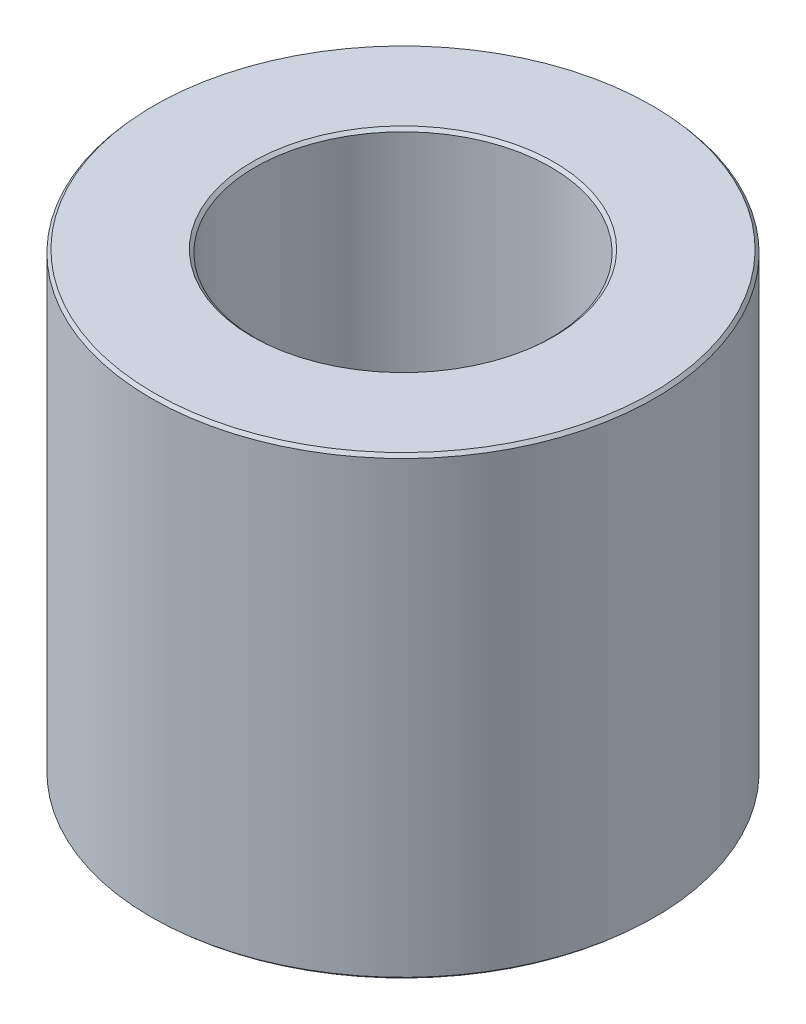
ISO-10303-21;
HEADER;
FILE_DESCRIPTION(('STEP AP214'),'2;1');
FILE_NAME('part.step','',(''),(''),'','','');
FILE_SCHEMA(('AUTOMOTIVE_DESIGN { 1 0 10303 214 1 1 1 1 }'));
ENDSEC;
DATA;
#1=APPLICATION_CONTEXT('core data for automotive mechanical design processes');
#2=APPLICATION_PROTOCOL_DEFINITION('international standard','automotive_design',2000,#1);
#3=PRODUCT_CONTEXT('',#1,'mechanical');
#4=PRODUCT('Part','Part','',(#3));
#5=PRODUCT_RELATED_PRODUCT_CATEGORY('part','',(#4));
#6=PRODUCT_DEFINITION_FORMATION('','',#4);
#7=PRODUCT_DEFINITION_CONTEXT('part definition',#1,'design');
#8=PRODUCT_DEFINITION('design','',#6,#7);
#9=PRODUCT_DEFINITION_SHAPE('','',#8);
#10=(LENGTH_UNIT() NAMED_UNIT(*) SI_UNIT(.MILLI.,.METRE.));
#11=(NAMED_UNIT(*) PLANE_ANGLE_UNIT() SI_UNIT($,.RADIAN.));
#12=(NAMED_UNIT(*) SI_UNIT($,.STERADIAN.) SOLID_ANGLE_UNIT());
#13=UNCERTAINTY_MEASURE_WITH_UNIT(LENGTH_MEASURE(1.E-05),#10,'distance_accuracy_value','');
#14=(GEOMETRIC_REPRESENTATION_CONTEXT(3) GLOBAL_UNCERTAINTY_ASSIGNED_CONTEXT((#13)) GLOBAL_UNIT_ASSIGNED_CONTEXT((#10,
#11,#12)) REPRESENTATION_CONTEXT('',''));
#15=CARTESIAN_POINT('',(0.,0.,0.));
#16=DIRECTION('',(0.,0.,1.));
#17=DIRECTION('',(1.,0.,0.));
#18=AXIS2_PLACEMENT_3D('',#15,#16,#17);
#19=CARTESIAN_POINT('',(0.,31.6429276659521,0.));
#20=DIRECTION('',(0.,-1.,0.));
#21=DIRECTION('',(0.,0.,-1.));
#22=AXIS2_PLACEMENT_3D('',#19,#20,#21);
#23=CYLINDRICAL_SURFACE('',#22,17.5);
#24=CARTESIAN_POINT('',(0.,0.197430008424614,0.));
#25=DIRECTION('',(0.,1.,0.));
#26=DIRECTION('',(0.,0.,1.));
#27=AXIS2_PLACEMENT_3D('',#24,#25,#26);
#28=CIRCLE('',#27,17.5);
#29=CARTESIAN_POINT('',(0.,0.197430008424614,17.5));
#30=VERTEX_POINT('',#29);
#31=EDGE_CURVE('E10',#30,#30,#28,.T.);
#32=ORIENTED_EDGE('',*,*,#31,.T.);
#33=EDGE_LOOP('',(#32));
#34=FACE_BOUND('',#33,.T.);
#35=CARTESIAN_POINT('',(0.,31.4214336692465,0.));
#36=DIRECTION('',(0.,1.,0.));
#37=DIRECTION('',(0.,0.,1.));
#38=AXIS2_PLACEMENT_3D('',#35,#36,#37);
#39=CIRCLE('',#38,17.5);
#40=CARTESIAN_POINT('',(0.,31.4214336692465,17.5));
#41=VERTEX_POINT('',#40);
#42=EDGE_CURVE('E50',#41,#41,#39,.F.);
#43=ORIENTED_EDGE('',*,*,#42,.T.);
#44=EDGE_LOOP('',(#43));
#45=FACE_BOUND('',#44,.T.);
#46=ADVANCED_FACE('F39',(#34,#45),#23,.T.);
#47=CARTESIAN_POINT('',(0.,31.6429276659521,0.));
#48=DIRECTION('',(0.,1.,0.));
#49=DIRECTION('',(0.,0.,1.));
#50=AXIS2_PLACEMENT_3D('',#47,#48,#49);
#51=PLANE('',#50);
#52=CARTESIAN_POINT('',(0.,31.6429276659521,0.));
#53=DIRECTION('',(0.,1.,0.));
#54=DIRECTION('',(0.,0.,1.));
#55=AXIS2_PLACEMENT_3D('',#52,#53,#54);
#56=CIRCLE('',#55,10.5000017148785);
#57=CARTESIAN_POINT('',(0.,31.6429276659521,10.5000017148785));
#58=VERTEX_POINT('',#57);
#59=EDGE_CURVE('E58',#58,#58,#56,.F.);
#60=ORIENTED_EDGE('',*,*,#59,.T.);
#61=EDGE_LOOP('',(#60));
#62=FACE_BOUND('',#61,.T.);
#63=CARTESIAN_POINT('',(0.,31.6429276659521,0.));
#64=DIRECTION('',(0.,1.,0.));
#65=DIRECTION('',(0.,0.,1.));
#66=AXIS2_PLACEMENT_3D('',#63,#64,#65);
#67=CIRCLE('',#66,17.3025699915754);
#68=CARTESIAN_POINT('',(0.,31.6429276659521,17.3025699915754));
#69=VERTEX_POINT('',#68);
#70=EDGE_CURVE('E61',#69,#69,#67,.T.);
#71=ORIENTED_EDGE('',*,*,#70,.T.);
#72=EDGE_LOOP('',(#71));
#73=FACE_BOUND('',#72,.T.);
#74=ADVANCED_FACE('F88',(#62,#73),#51,.T.);
#75=CARTESIAN_POINT('',(0.,0.,0.));
#76=DIRECTION('',(0.,1.,0.));
#77=DIRECTION('',(0.,0.,1.));
#78=AXIS2_PLACEMENT_3D('',#75,#76,#77);
#79=PLANE('',#78);
#80=CARTESIAN_POINT('',(0.,0.,0.));
#81=DIRECTION('',(0.,1.,0.));
#82=DIRECTION('',(0.,0.,1.));
#83=AXIS2_PLACEMENT_3D('',#80,#81,#82);
#84=CIRCLE('',#83,10.4759377265976);
#85=CARTESIAN_POINT('',(0.,0.,10.4759377265976));
#86=VERTEX_POINT('',#85);
#87=EDGE_CURVE('E51',#86,#86,#84,.T.);
#88=ORIENTED_EDGE('',*,*,#87,.T.);
#89=EDGE_LOOP('',(#88));
#90=FACE_BOUND('',#89,.T.);
#91=CARTESIAN_POINT('',(0.,0.,0.));
#92=DIRECTION('',(0.,1.,0.));
#93=DIRECTION('',(0.,0.,1.));
#94=AXIS2_PLACEMENT_3D('',#91,#92,#93);
#95=CIRCLE('',#94,17.2785060032944);
#96=CARTESIAN_POINT('',(0.,0.,17.2785060032944));
#97=VERTEX_POINT('',#96);
#98=EDGE_CURVE('E54',#97,#97,#95,.F.);
#99=ORIENTED_EDGE('',*,*,#98,.T.);
#100=EDGE_LOOP('',(#99));
#101=FACE_BOUND('',#100,.T.);
#102=ADVANCED_FACE('F83',(#90,#101),#79,.F.);
#103=CARTESIAN_POINT('',(0.,31.6429276659521,0.));
#104=DIRECTION('',(0.,-1.,0.));
#105=DIRECTION('',(0.,0.,-1.));
#106=AXIS2_PLACEMENT_3D('',#103,#104,#105);
#107=CYLINDRICAL_SURFACE('',#106,10.2785077181729);
#108=CARTESIAN_POINT('',(0.,31.4454976575275,0.));
#109=DIRECTION('',(0.,1.,0.));
#110=DIRECTION('',(0.,0.,1.));
#111=AXIS2_PLACEMENT_3D('',#108,#109,#110);
#112=CIRCLE('',#111,10.2785077181729);
#113=CARTESIAN_POINT('',(0.,31.4454976575275,10.2785077181729));
#114=VERTEX_POINT('',#113);
#115=EDGE_CURVE('E67',#114,#114,#112,.T.);
#116=ORIENTED_EDGE('',*,*,#115,.T.);
#117=EDGE_LOOP('',(#116));
#118=FACE_BOUND('',#117,.T.);
#119=CARTESIAN_POINT('',(0.,0.221493996705589,0.));
#120=DIRECTION('',(0.,1.,0.));
#121=DIRECTION('',(0.,0.,1.));
#122=AXIS2_PLACEMENT_3D('',#119,#120,#121);
#123=CIRCLE('',#122,10.2785077181729);
#124=CARTESIAN_POINT('',(0.,0.221493996705589,10.2785077181729));
#125=VERTEX_POINT('',#124);
#126=EDGE_CURVE('E69',#125,#125,#123,.F.);
#127=ORIENTED_EDGE('',*,*,#126,.T.);
#128=EDGE_LOOP('',(#127));
#129=FACE_BOUND('',#128,.T.);
#130=ADVANCED_FACE('F71',(#118,#129),#107,.F.);
#131=CARTESIAN_POINT('',(0.,31.4454976575275,0.));
#132=DIRECTION('',(0.,1.,0.));
#133=DIRECTION('',(0.,0.,1.));
#134=AXIS2_PLACEMENT_3D('',#131,#132,#133);
#135=CONICAL_SURFACE('',#134,10.2785077181729,0.842777480112497);
#136=CARTESIAN_POINT('',(0.,31.6429276659521,10.5000017148785));
#137=CARTESIAN_POINT('',(0.,31.6408711033644,10.4976944857462));
#138=CARTESIAN_POINT('',(0.,31.6388145407766,10.4953872566138));
#139=CARTESIAN_POINT('',(0.,31.6347014156011,10.4907727983491));
#140=CARTESIAN_POINT('',(0.,31.6326448530133,10.4884655692168));
#141=CARTESIAN_POINT('',(0.,31.6285317278378,10.4838511109521));
#142=CARTESIAN_POINT('',(0.,31.6264751652501,10.4815438818197));
#143=CARTESIAN_POINT('',(0.,31.6223620400746,10.476929423555));
#144=CARTESIAN_POINT('',(0.,31.6203054774868,10.4746221944227));
#145=CARTESIAN_POINT('',(0.,31.6161923523113,10.470007736158));
#146=CARTESIAN_POINT('',(0.,31.6141357897235,10.4677005070256));
#147=CARTESIAN_POINT('',(0.,31.610022664548,10.4630860487609));
#148=CARTESIAN_POINT('',(0.,31.6079661019603,10.4607788196286));
#149=CARTESIAN_POINT('',(0.,31.6038529767848,10.4561643613639));
#150=CARTESIAN_POINT('',(0.,31.601796414197,10.4538571322315));
#151=CARTESIAN_POINT('',(0.,31.5976832890215,10.4492426739668));
#152=CARTESIAN_POINT('',(0.,31.5956267264337,10.4469354448345));
#153=CARTESIAN_POINT('',(0.,31.5915136012582,10.4423209865698));
#154=CARTESIAN_POINT('',(0.,31.5894570386705,10.4400137574374));
#155=CARTESIAN_POINT('',(0.,31.5853439134949,10.4353992991727));
#156=CARTESIAN_POINT('',(0.,31.5832873509072,10.4330920700404));
#157=CARTESIAN_POINT('',(0.,31.5791742257317,10.4284776117757));
#158=CARTESIAN_POINT('',(0.,31.5771176631439,10.4261703826433));
#159=CARTESIAN_POINT('',(0.,31.5730045379684,10.4215559243786));
#160=CARTESIAN_POINT('',(0.,31.5709479753806,10.4192486952463));
#161=CARTESIAN_POINT('',(0.,31.5668348502051,10.4146342369816));
#162=CARTESIAN_POINT('',(0.,31.5647782876174,10.4123270078492));
#163=CARTESIAN_POINT('',(0.,31.5606651624419,10.4077125495845));
#164=CARTESIAN_POINT('',(0.,31.5586085998541,10.4054053204522));
#165=CARTESIAN_POINT('',(0.,31.5544954746786,10.4007908621875));
#166=CARTESIAN_POINT('',(0.,31.5524389120908,10.3984836330551));
#167=CARTESIAN_POINT('',(0.,31.5483257869153,10.3938691747904));
#168=CARTESIAN_POINT('',(0.,31.5462692243276,10.3915619456581));
#169=CARTESIAN_POINT('',(0.,31.5421560991521,10.3869474873934));
#170=CARTESIAN_POINT('',(0.,31.5400995365643,10.384640258261));
#171=CARTESIAN_POINT('',(0.,31.5359864113888,10.3800257999963));
#172=CARTESIAN_POINT('',(0.,31.533929848801,10.377718570864));
#173=CARTESIAN_POINT('',(0.,31.5298167236255,10.3731041125993));
#174=CARTESIAN_POINT('',(0.,31.5277601610378,10.3707968834669));
#175=CARTESIAN_POINT('',(0.,31.5236470358623,10.3661824252022));
#176=CARTESIAN_POINT('',(0.,31.5215904732745,10.3638751960699));
#177=CARTESIAN_POINT('',(0.,31.517477348099,10.3592607378052));
#178=CARTESIAN_POINT('',(0.,31.5154207855112,10.3569535086728));
#179=CARTESIAN_POINT('',(0.,31.5113076603357,10.3523390504081));
#180=CARTESIAN_POINT('',(0.,31.509251097748,10.3500318212758));
#181=CARTESIAN_POINT('',(0.,31.5051379725724,10.3454173630111));
#182=CARTESIAN_POINT('',(0.,31.5030814099847,10.3431101338787));
#183=CARTESIAN_POINT('',(0.,31.4989682848092,10.338495675614));
#184=CARTESIAN_POINT('',(0.,31.4969117222214,10.3361884464817));
#185=CARTESIAN_POINT('',(0.,31.4927985970459,10.331573988217));
#186=CARTESIAN_POINT('',(0.,31.4907420344581,10.3292667590846));
#187=CARTESIAN_POINT('',(0.,31.4866289092826,10.3246523008199));
#188=CARTESIAN_POINT('',(0.,31.4845723466949,10.3223450716876));
#189=CARTESIAN_POINT('',(0.,31.4804592215194,10.3177306134229));
#190=CARTESIAN_POINT('',(0.,31.4784026589316,10.3154233842905));
#191=CARTESIAN_POINT('',(0.,31.4742895337561,10.3108089260258));
#192=CARTESIAN_POINT('',(0.,31.4722329711683,10.3085016968935));
#193=CARTESIAN_POINT('',(0.,31.4681198459928,10.3038872386288));
#194=CARTESIAN_POINT('',(0.,31.4660632834051,10.3015800094964));
#195=CARTESIAN_POINT('',(0.,31.4619501582296,10.2969655512317));
#196=CARTESIAN_POINT('',(0.,31.4598935956418,10.2946583220994));
#197=CARTESIAN_POINT('',(0.,31.4557804704663,10.2900438638347));
#198=CARTESIAN_POINT('',(0.,31.4537239078785,10.2877366347023));
#199=CARTESIAN_POINT('',(0.,31.449610782703,10.2831221764376));
#200=CARTESIAN_POINT('',(0.,31.4475542201153,10.2808149473053));
#201=CARTESIAN_POINT('',(0.,31.4454976575275,10.2785077181729));
#202=B_SPLINE_CURVE_WITH_KNOTS('',3,(#136,#137,#138,#139,#140,#141,#142,#143,#144,#145,#146,
#147,#148,#149,#150,#151,#152,#153,#154,#155,#156,#157,#158,#159,#160,#161,#162,#163,#164,#165,
#166,#167,#168,#169,#170,#171,#172,#173,#174,#175,#176,#177,#178,#179,#180,#181,#182,#183,#184,
#185,#186,#187,#188,#189,#190,#191,#192,#193,#194,#195,#196,#197,#198,#199,#200,#201),
.UNSPECIFIED.,.F.,.F.,(4,2,2,2,2,2,2,2,2,2,2,2,2,2,2,2,2,2,2,2,2,2,2,2,2,2,2,2,2,2,2,2,4),(0.,
0.00927225989274612,0.0185445197854982,0.0278167796782489,0.0370890395709996,0.0463612994637504,
0.0556335593565011,0.0649058192492472,0.0741780791419993,0.08345033903475,0.0927225989275007,
0.101994858820251,0.111267118713002,0.120539378605748,0.129811638498499,0.139083898391251,
0.148356158284002,0.157628418176753,0.166900678069503,0.176172937962254,0.185445197855,
0.194717457747752,0.203989717640503,0.213261977533254,0.222534237426004,0.231806497318755,
0.241078757211501,0.250351017104252,0.259623276997004,0.268895536889755,0.278167796782506,
0.287440056675256,0.296712316568002),.UNSPECIFIED.);
#203=EDGE_CURVE('BSEAM77',#58,#114,#202,.T.);
#204=ORIENTED_EDGE('',*,*,#59,.F.);
#205=ORIENTED_EDGE('',*,*,#115,.F.);
#206=ORIENTED_EDGE('',*,*,#203,.T.);
#207=ORIENTED_EDGE('',*,*,#203,.F.);
#208=EDGE_LOOP('',(#204,#206,#205,#207));
#209=FACE_BOUND('',#208,.T.);
#210=ADVANCED_FACE('F77',(#209),#135,.F.);
#211=CARTESIAN_POINT('',(0.,0.,0.));
#212=DIRECTION('',(0.,-1.,0.));
#213=DIRECTION('',(0.,0.,-1.));
#214=AXIS2_PLACEMENT_3D('',#211,#212,#213);
#215=CONICAL_SURFACE('',#214,10.4759377265976,0.728018846682429);
#216=ORIENTED_EDGE('',*,*,#126,.F.);
#217=EDGE_LOOP('',(#216));
#218=FACE_BOUND('',#217,.T.);
#219=ORIENTED_EDGE('',*,*,#87,.F.);
#220=EDGE_LOOP('',(#219));
#221=FACE_BOUND('',#220,.T.);
#222=ADVANCED_FACE('F73',(#218,#221),#215,.F.);
#223=CARTESIAN_POINT('',(0.,0.197430008424614,0.));
#224=DIRECTION('',(0.,1.,0.));
#225=DIRECTION('',(0.,0.,1.));
#226=AXIS2_PLACEMENT_3D('',#223,#224,#225);
#227=CONICAL_SURFACE('',#226,17.5,0.842777480112493);
#228=CARTESIAN_POINT('',(0.,0.,17.2785060032944));
#229=CARTESIAN_POINT('',(0.,0.00205656258775636,17.2808132324268));
#230=CARTESIAN_POINT('',(0.,0.00411312517551276,17.2831204615591));
#231=CARTESIAN_POINT('',(0.,0.00822625035102554,17.2877349198238));
#232=CARTESIAN_POINT('',(0.,0.0102828129387819,17.2900421489562));
#233=CARTESIAN_POINT('',(0.,0.0143959381142947,17.2946566072209));
#234=CARTESIAN_POINT('',(0.,0.0164525007020511,17.2969638363532));
#235=CARTESIAN_POINT('',(0.,0.0205656258775639,17.3015782946179));
#236=CARTESIAN_POINT('',(0.,0.0226221884653203,17.3038855237503));
#237=CARTESIAN_POINT('',(0.,0.0267353136408331,17.308499982015));
#238=CARTESIAN_POINT('',(0.,0.0287918762285895,17.3108072111473));
#239=CARTESIAN_POINT('',(0.,0.0329050014041022,17.315421669412));
#240=CARTESIAN_POINT('',(0.,0.0349615639918587,17.3177288985444));
#241=CARTESIAN_POINT('',(0.,0.0390746891673714,17.3223433568091));
#242=CARTESIAN_POINT('',(0.,0.0411312517551277,17.3246505859414));
#243=CARTESIAN_POINT('',(0.,0.0452443769306407,17.3292650442061));
#244=CARTESIAN_POINT('',(0.,0.0473009395183974,17.3315722733385));
#245=CARTESIAN_POINT('',(0.,0.05141406469391,17.3361867316032));
#246=CARTESIAN_POINT('',(0.,0.0534706272816659,17.3384939607355));
#247=CARTESIAN_POINT('',(0.,0.0575837524571786,17.3431084190002));
#248=CARTESIAN_POINT('',(0.,0.0596403150449352,17.3454156481326));
#249=CARTESIAN_POINT('',(0.,0.0637534402204482,17.3500301063973));
#250=CARTESIAN_POINT('',(0.,0.0658100028082045,17.3523373355296));
#251=CARTESIAN_POINT('',(0.,0.0699231279837173,17.3569517937943));
#252=CARTESIAN_POINT('',(0.,0.0719796905714737,17.3592590229267));
#253=CARTESIAN_POINT('',(0.,0.0760928157469865,17.3638734811914));
#254=CARTESIAN_POINT('',(0.,0.0781493783347429,17.3661807103237));
#255=CARTESIAN_POINT('',(0.,0.0822625035102556,17.3707951685884));
#256=CARTESIAN_POINT('',(0.,0.084319066098012,17.3731023977208));
#257=CARTESIAN_POINT('',(0.,0.0884321912735248,17.3777168559855));
#258=CARTESIAN_POINT('',(0.,0.0904887538612812,17.3800240851178));
#259=CARTESIAN_POINT('',(0.,0.094601879036794,17.3846385433825));
#260=CARTESIAN_POINT('',(0.,0.0966584416245504,17.3869457725149));
#261=CARTESIAN_POINT('',(0.,0.100771566800063,17.3915602307796));
#262=CARTESIAN_POINT('',(0.,0.10282812938782,17.3938674599119));
#263=CARTESIAN_POINT('',(0.,0.106941254563332,17.3984819181766));
#264=CARTESIAN_POINT('',(0.,0.108997817151089,17.400789147309));
#265=CARTESIAN_POINT('',(0.,0.113110942326602,17.4054036055737));
#266=CARTESIAN_POINT('',(0.,0.115167504914358,17.407710834706));
#267=CARTESIAN_POINT('',(0.,0.119280630089871,17.4123252929707));
#268=CARTESIAN_POINT('',(0.,0.121337192677627,17.4146325221031));
#269=CARTESIAN_POINT('',(0.,0.12545031785314,17.4192469803678));
#270=CARTESIAN_POINT('',(0.,0.127506880440896,17.4215542095001));
#271=CARTESIAN_POINT('',(0.,0.131620005616409,17.4261686677648));
#272=CARTESIAN_POINT('',(0.,0.133676568204165,17.4284758968972));
#273=CARTESIAN_POINT('',(0.,0.137789693379678,17.4330903551619));
#274=CARTESIAN_POINT('',(0.,0.139846255967435,17.4353975842942));
#275=CARTESIAN_POINT('',(0.,0.143959381142947,17.4400120425589));
#276=CARTESIAN_POINT('',(0.,0.146015943730704,17.4423192716913));
#277=CARTESIAN_POINT('',(0.,0.150129068906217,17.446933729956));
#278=CARTESIAN_POINT('',(0.,0.152185631493973,17.4492409590883));
#279=CARTESIAN_POINT('',(0.,0.156298756669485,17.453855417353));
#280=CARTESIAN_POINT('',(0.,0.158355319257242,17.4561626464854));
#281=CARTESIAN_POINT('',(0.,0.162468444432755,17.4607771047501));
#282=CARTESIAN_POINT('',(0.,0.164525007020511,17.4630843338824));
#283=CARTESIAN_POINT('',(0.,0.168638132196024,17.4676987921471));
#284=CARTESIAN_POINT('',(0.,0.17069469478378,17.4700060212795));
#285=CARTESIAN_POINT('',(0.,0.174807819959293,17.4746204795442));
#286=CARTESIAN_POINT('',(0.,0.17686438254705,17.4769277086765));
#287=CARTESIAN_POINT('',(0.,0.180977507722562,17.4815421669412));
#288=CARTESIAN_POINT('',(0.,0.183034070310319,17.4838493960736));
#289=CARTESIAN_POINT('',(0.,0.187147195485832,17.4884638543383));
#290=CARTESIAN_POINT('',(0.,0.189203758073588,17.4907710834706));
#291=CARTESIAN_POINT('',(0.,0.193316883249101,17.4953855417353));
#292=CARTESIAN_POINT('',(0.,0.195373445836857,17.4976927708677));
#293=CARTESIAN_POINT('',(0.,0.197430008424614,17.5));
#294=B_SPLINE_CURVE_WITH_KNOTS('',3,(#228,#229,#230,#231,#232,#233,#234,#235,#236,#237,#238,
#239,#240,#241,#242,#243,#244,#245,#246,#247,#248,#249,#250,#251,#252,#253,#254,#255,#256,#257,
#258,#259,#260,#261,#262,#263,#264,#265,#266,#267,#268,#269,#270,#271,#272,#273,#274,#275,#276,
#277,#278,#279,#280,#281,#282,#283,#284,#285,#286,#287,#288,#289,#290,#291,#292,#293),
.UNSPECIFIED.,.F.,.F.,(4,2,2,2,2,2,2,2,2,2,2,2,2,2,2,2,2,2,2,2,2,2,2,2,2,2,2,2,2,2,2,2,4),(0.,
0.00927225989275002,0.0185445197855,0.0278167796782501,0.0370890395710001,0.0463612994637501,
0.0556335593565001,0.0649058192492501,0.0741780791420001,0.0834503390347528,0.0927225989275028,
0.101994858820253,0.111267118713003,0.120539378605753,0.129811638498503,0.139083898391253,
0.148356158284003,0.157628418176753,0.166900678069503,0.176172937962253,0.185445197855003,
0.194717457747753,0.203989717640503,0.213261977533253,0.222534237426003,0.231806497318756,
0.241078757211506,0.250351017104256,0.259623276997006,0.268895536889756,0.278167796782506,
0.287440056675256,0.296712316568006),.UNSPECIFIED.);
#295=EDGE_CURVE('BSEAM76',#97,#30,#294,.T.);
#296=ORIENTED_EDGE('',*,*,#98,.F.);
#297=ORIENTED_EDGE('',*,*,#31,.F.);
#298=ORIENTED_EDGE('',*,*,#295,.T.);
#299=ORIENTED_EDGE('',*,*,#295,.F.);
#300=EDGE_LOOP('',(#296,#298,#297,#299));
#301=FACE_BOUND('',#300,.T.);
#302=ADVANCED_FACE('F76',(#301),#227,.T.);
#303=CARTESIAN_POINT('',(0.,31.6429276659521,0.));
#304=DIRECTION('',(0.,-1.,0.));
#305=DIRECTION('',(0.,0.,-1.));
#306=AXIS2_PLACEMENT_3D('',#303,#304,#305);
#307=CONICAL_SURFACE('',#306,17.3025699915754,0.728018846682418);
#308=ORIENTED_EDGE('',*,*,#42,.F.);
#309=EDGE_LOOP('',(#308));
#310=FACE_BOUND('',#309,.T.);
#311=ORIENTED_EDGE('',*,*,#70,.F.);
#312=EDGE_LOOP('',(#311));
#313=FACE_BOUND('',#312,.T.);
#314=ADVANCED_FACE('F45',(#310,#313),#307,.T.);
#315=CLOSED_SHELL('',(#46,#74,#102,#130,#210,#222,#302,#314));
#316=MANIFOLD_SOLID_BREP('B2',#315);
#317=ADVANCED_BREP_SHAPE_REPRESENTATION('',(#18,#316),#14);
#318=SHAPE_DEFINITION_REPRESENTATION(#9,#317);
ENDSEC;
END-ISO-10303-21;
